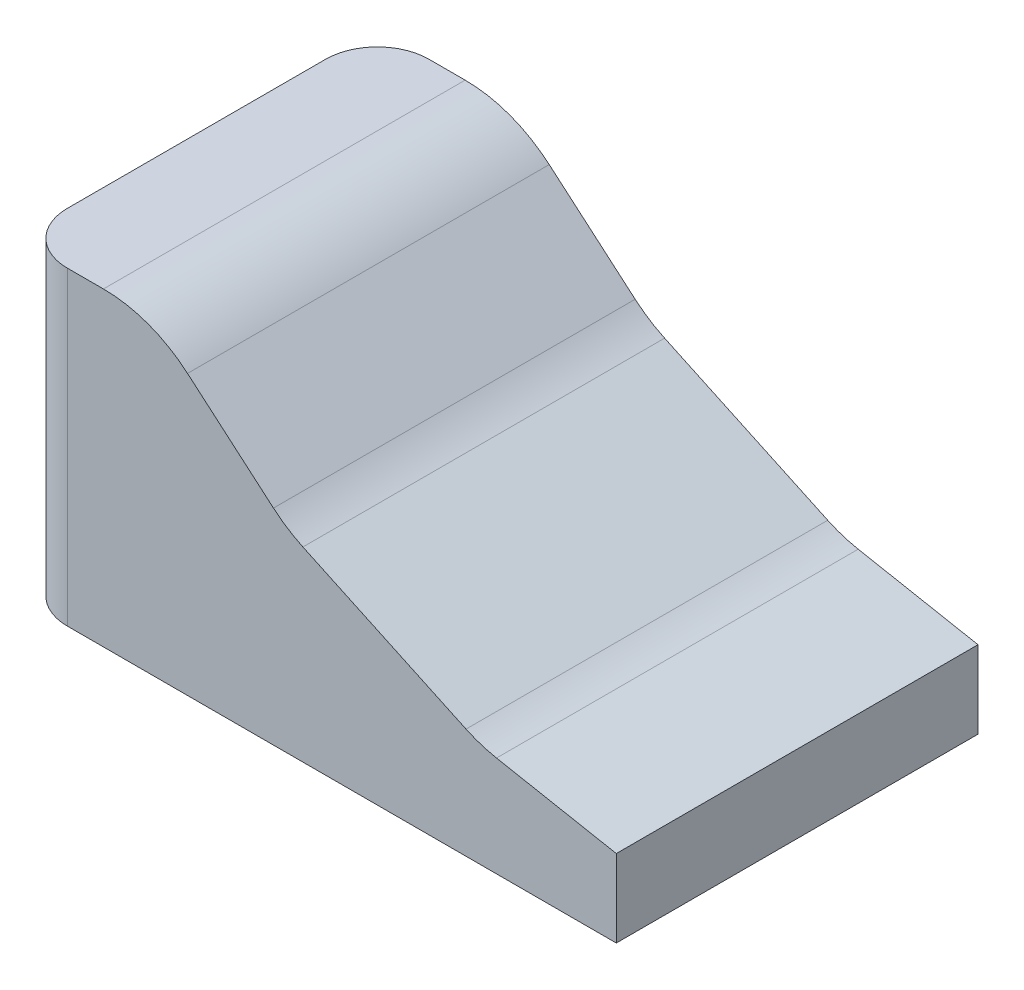
ISO-10303-21;
HEADER;
FILE_DESCRIPTION(('STEP AP214'),'2;1');
FILE_NAME('part.step','',(''),(''),'','','');
FILE_SCHEMA(('AUTOMOTIVE_DESIGN { 1 0 10303 214 1 1 1 1 }'));
ENDSEC;
DATA;
#1=APPLICATION_CONTEXT('core data for automotive mechanical design processes');
#2=APPLICATION_PROTOCOL_DEFINITION('international standard','automotive_design',2000,#1);
#3=PRODUCT_CONTEXT('',#1,'mechanical');
#4=PRODUCT('Part','Part','',(#3));
#5=PRODUCT_RELATED_PRODUCT_CATEGORY('part','',(#4));
#6=PRODUCT_DEFINITION_FORMATION('','',#4);
#7=PRODUCT_DEFINITION_CONTEXT('part definition',#1,'design');
#8=PRODUCT_DEFINITION('design','',#6,#7);
#9=PRODUCT_DEFINITION_SHAPE('','',#8);
#10=(LENGTH_UNIT() NAMED_UNIT(*) SI_UNIT(.MILLI.,.METRE.));
#11=(NAMED_UNIT(*) PLANE_ANGLE_UNIT() SI_UNIT($,.RADIAN.));
#12=(NAMED_UNIT(*) SI_UNIT($,.STERADIAN.) SOLID_ANGLE_UNIT());
#13=UNCERTAINTY_MEASURE_WITH_UNIT(LENGTH_MEASURE(1.E-05),#10,'distance_accuracy_value','');
#14=(GEOMETRIC_REPRESENTATION_CONTEXT(3) GLOBAL_UNCERTAINTY_ASSIGNED_CONTEXT((#13)) GLOBAL_UNIT_ASSIGNED_CONTEXT((#10,
#11,#12)) REPRESENTATION_CONTEXT('',''));
#15=CARTESIAN_POINT('',(0.,0.,0.));
#16=DIRECTION('',(0.,0.,1.));
#17=DIRECTION('',(1.,0.,0.));
#18=AXIS2_PLACEMENT_3D('',#15,#16,#17);
#19=CARTESIAN_POINT('',(228.600000000029,50.8,-177.8));
#20=DIRECTION('',(0.422885465331046,0.906183139995302,0.));
#21=DIRECTION('',(-0.906183139995302,0.422885465331046,0.));
#22=AXIS2_PLACEMENT_3D('',#19,#20,#21);
#23=PLANE('',#22);
#24=DIRECTION('',(-0.906183139995302,0.422885465331046,0.));
#25=VECTOR('',#24,1.);
#26=CARTESIAN_POINT('',(228.600000000029,50.8,0.));
#27=LINE('',#26,#25);
#28=CARTESIAN_POINT('',(221.416064077509,54.1525034305082,0.));
#29=VERTEX_POINT('',#28);
#30=CARTESIAN_POINT('',(141.224379885032,91.5752893869893,0.));
#31=VERTEX_POINT('',#30);
#32=EDGE_CURVE('E152',#29,#31,#27,.T.);
#33=ORIENTED_EDGE('',*,*,#32,.F.);
#34=DIRECTION('',(0.,0.,1.));
#35=VECTOR('',#34,1.);
#36=CARTESIAN_POINT('',(221.416064077509,54.1525034305082,-177.8));
#37=LINE('',#36,#35);
#38=CARTESIAN_POINT('',(221.416064077509,54.1525034305082,-177.8));
#39=VERTEX_POINT('',#38);
#40=EDGE_CURVE('E177',#29,#39,#37,.F.);
#41=ORIENTED_EDGE('',*,*,#40,.T.);
#42=DIRECTION('',(-0.906183139995302,0.422885465331046,0.));
#43=VECTOR('',#42,1.);
#44=CARTESIAN_POINT('',(228.600000000029,50.8,-177.8));
#45=LINE('',#44,#43);
#46=CARTESIAN_POINT('',(141.224379885032,91.5752893869893,-177.8));
#47=VERTEX_POINT('',#46);
#48=EDGE_CURVE('E166',#39,#47,#45,.T.);
#49=ORIENTED_EDGE('',*,*,#48,.T.);
#50=DIRECTION('',(0.,0.,1.));
#51=VECTOR('',#50,1.);
#52=CARTESIAN_POINT('',(141.224379885032,91.5752893869893,0.));
#53=LINE('',#52,#51);
#54=EDGE_CURVE('E174',#47,#31,#53,.T.);
#55=ORIENTED_EDGE('',*,*,#54,.T.);
#56=EDGE_LOOP('',(#33,#41,#49,#55));
#57=FACE_BOUND('',#56,.T.);
#58=ADVANCED_FACE('F31',(#57),#23,.T.);
#59=CARTESIAN_POINT('',(295.275,38.1,-177.8));
#60=DIRECTION('',(0.187112107890072,0.98233856642246,0.));
#61=DIRECTION('',(-0.98233856642246,0.187112107890072,0.));
#62=AXIS2_PLACEMENT_3D('',#59,#60,#61);
#63=PLANE('',#62);
#64=DIRECTION('',(-0.98233856642246,0.187112107890072,0.));
#65=VECTOR('',#64,1.);
#66=CARTESIAN_POINT('',(295.275,38.1,-177.8));
#67=LINE('',#66,#65);
#68=CARTESIAN_POINT('',(295.275,38.1,-177.8));
#69=VERTEX_POINT('',#68);
#70=CARTESIAN_POINT('',(236.387672275011,49.3166338523836,-177.8));
#71=VERTEX_POINT('',#70);
#72=EDGE_CURVE('E146',#69,#71,#67,.T.);
#73=ORIENTED_EDGE('',*,*,#72,.T.);
#74=DIRECTION('',(0.,0.,1.));
#75=VECTOR('',#74,1.);
#76=CARTESIAN_POINT('',(236.387672275011,49.3166338523836,0.));
#77=LINE('',#76,#75);
#78=CARTESIAN_POINT('',(236.387672275011,49.3166338523836,0.));
#79=VERTEX_POINT('',#78);
#80=EDGE_CURVE('E167',#71,#79,#77,.T.);
#81=ORIENTED_EDGE('',*,*,#80,.T.);
#82=DIRECTION('',(-0.98233856642246,0.187112107890072,0.));
#83=VECTOR('',#82,1.);
#84=CARTESIAN_POINT('',(295.275,38.1,0.));
#85=LINE('',#84,#83);
#86=CARTESIAN_POINT('',(295.275,38.1,0.));
#87=VERTEX_POINT('',#86);
#88=EDGE_CURVE('E163',#87,#79,#85,.T.);
#89=ORIENTED_EDGE('',*,*,#88,.F.);
#90=DIRECTION('',(0.,0.,1.));
#91=VECTOR('',#90,1.);
#92=CARTESIAN_POINT('',(295.275,38.1,-177.8));
#93=LINE('',#92,#91);
#94=EDGE_CURVE('E141',#69,#87,#93,.T.);
#95=ORIENTED_EDGE('',*,*,#94,.F.);
#96=EDGE_LOOP('',(#73,#81,#89,#95));
#97=FACE_BOUND('',#96,.T.);
#98=ADVANCED_FACE('F227',(#97),#63,.T.);
#99=CARTESIAN_POINT('',(295.275,0.,-177.8));
#100=DIRECTION('',(1.,0.,0.));
#101=DIRECTION('',(0.,0.,-1.));
#102=AXIS2_PLACEMENT_3D('',#99,#100,#101);
#103=PLANE('',#102);
#104=DIRECTION('',(0.,1.,0.));
#105=VECTOR('',#104,1.);
#106=CARTESIAN_POINT('',(295.275,0.,0.));
#107=LINE('',#106,#105);
#108=CARTESIAN_POINT('',(295.275,0.,0.));
#109=VERTEX_POINT('',#108);
#110=EDGE_CURVE('E140',#109,#87,#107,.T.);
#111=ORIENTED_EDGE('',*,*,#110,.F.);
#112=DIRECTION('',(0.,0.,1.));
#113=VECTOR('',#112,1.);
#114=CARTESIAN_POINT('',(295.275,0.,-177.8));
#115=LINE('',#114,#113);
#116=CARTESIAN_POINT('',(295.275,0.,-177.8));
#117=VERTEX_POINT('',#116);
#118=EDGE_CURVE('E128',#117,#109,#115,.T.);
#119=ORIENTED_EDGE('',*,*,#118,.F.);
#120=DIRECTION('',(0.,1.,0.));
#121=VECTOR('',#120,1.);
#122=CARTESIAN_POINT('',(295.275,0.,-177.8));
#123=LINE('',#122,#121);
#124=EDGE_CURVE('E132',#117,#69,#123,.T.);
#125=ORIENTED_EDGE('',*,*,#124,.T.);
#126=ORIENTED_EDGE('',*,*,#94,.T.);
#127=EDGE_LOOP('',(#111,#119,#125,#126));
#128=FACE_BOUND('',#127,.T.);
#129=ADVANCED_FACE('F137',(#128),#103,.T.);
#130=CARTESIAN_POINT('',(0.,0.,-177.8));
#131=DIRECTION('',(0.,-1.,0.));
#132=DIRECTION('',(0.,0.,-1.));
#133=AXIS2_PLACEMENT_3D('',#130,#131,#132);
#134=PLANE('',#133);
#135=DIRECTION('',(0.,0.,1.));
#136=VECTOR('',#135,1.);
#137=CARTESIAN_POINT('',(0.,0.,-177.8));
#138=LINE('',#137,#136);
#139=CARTESIAN_POINT('',(0.,0.,-152.4));
#140=VERTEX_POINT('',#139);
#141=CARTESIAN_POINT('',(0.,0.,-25.4));
#142=VERTEX_POINT('',#141);
#143=EDGE_CURVE('E142',#140,#142,#138,.T.);
#144=ORIENTED_EDGE('',*,*,#143,.F.);
#145=CARTESIAN_POINT('',(25.4,0.,-152.4));
#146=DIRECTION('',(0.,-1.,0.));
#147=DIRECTION('',(0.,0.,-1.));
#148=AXIS2_PLACEMENT_3D('',#145,#146,#147);
#149=CIRCLE('',#148,25.4);
#150=CARTESIAN_POINT('',(25.4,0.,-177.8));
#151=VERTEX_POINT('',#150);
#152=EDGE_CURVE('E130',#140,#151,#149,.T.);
#153=ORIENTED_EDGE('',*,*,#152,.T.);
#154=DIRECTION('',(1.,0.,0.));
#155=VECTOR('',#154,1.);
#156=CARTESIAN_POINT('',(0.,0.,-177.8));
#157=LINE('',#156,#155);
#158=EDGE_CURVE('E123',#151,#117,#157,.T.);
#159=ORIENTED_EDGE('',*,*,#158,.T.);
#160=ORIENTED_EDGE('',*,*,#118,.T.);
#161=DIRECTION('',(1.,0.,0.));
#162=VECTOR('',#161,1.);
#163=CARTESIAN_POINT('',(0.,0.,0.));
#164=LINE('',#163,#162);
#165=CARTESIAN_POINT('',(25.4,0.,0.));
#166=VERTEX_POINT('',#165);
#167=EDGE_CURVE('E160',#166,#109,#164,.T.);
#168=ORIENTED_EDGE('',*,*,#167,.F.);
#169=CARTESIAN_POINT('',(25.4,0.,-25.4));
#170=DIRECTION('',(0.,-1.,0.));
#171=DIRECTION('',(0.,0.,-1.));
#172=AXIS2_PLACEMENT_3D('',#169,#170,#171);
#173=CIRCLE('',#172,25.4);
#174=EDGE_CURVE('E203',#166,#142,#173,.T.);
#175=ORIENTED_EDGE('',*,*,#174,.T.);
#176=EDGE_LOOP('',(#144,#153,#159,#160,#168,#175));
#177=FACE_BOUND('',#176,.T.);
#178=ADVANCED_FACE('F126',(#177),#134,.T.);
#179=CARTESIAN_POINT('',(0.,152.4,-177.8));
#180=DIRECTION('',(-1.,0.,0.));
#181=DIRECTION('',(0.,-1.,0.));
#182=AXIS2_PLACEMENT_3D('',#179,#180,#181);
#183=PLANE('',#182);
#184=DIRECTION('',(0.,0.,1.));
#185=VECTOR('',#184,1.);
#186=CARTESIAN_POINT('',(0.,152.4,-177.8));
#187=LINE('',#186,#185);
#188=CARTESIAN_POINT('',(0.,152.4,-152.4));
#189=VERTEX_POINT('',#188);
#190=CARTESIAN_POINT('',(0.,152.4,-25.4));
#191=VERTEX_POINT('',#190);
#192=EDGE_CURVE('E148',#189,#191,#187,.T.);
#193=ORIENTED_EDGE('',*,*,#192,.F.);
#194=DIRECTION('',(0.,-1.,0.));
#195=VECTOR('',#194,1.);
#196=CARTESIAN_POINT('',(0.,0.,-152.4));
#197=LINE('',#196,#195);
#198=EDGE_CURVE('E200',#189,#140,#197,.T.);
#199=ORIENTED_EDGE('',*,*,#198,.T.);
#200=ORIENTED_EDGE('',*,*,#143,.T.);
#201=DIRECTION('',(0.,-1.,0.));
#202=VECTOR('',#201,1.);
#203=CARTESIAN_POINT('',(0.,152.4,-25.4));
#204=LINE('',#203,#202);
#205=EDGE_CURVE('E198',#142,#191,#204,.F.);
#206=ORIENTED_EDGE('',*,*,#205,.T.);
#207=EDGE_LOOP('',(#193,#199,#200,#206));
#208=FACE_BOUND('',#207,.T.);
#209=ADVANCED_FACE('F213',(#208),#183,.T.);
#210=CARTESIAN_POINT('',(66.675000000032,152.4,-177.8));
#211=DIRECTION('',(0.,1.,0.));
#212=DIRECTION('',(0.,0.,1.));
#213=AXIS2_PLACEMENT_3D('',#210,#211,#212);
#214=PLANE('',#213);
#215=DIRECTION('',(-1.,0.,0.));
#216=VECTOR('',#215,1.);
#217=CARTESIAN_POINT('',(66.675000000032,152.4,-177.8));
#218=LINE('',#217,#216);
#219=CARTESIAN_POINT('',(43.1848211603423,152.4,-177.8));
#220=VERTEX_POINT('',#219);
#221=CARTESIAN_POINT('',(25.4,152.4,-177.8));
#222=VERTEX_POINT('',#221);
#223=EDGE_CURVE('E133',#220,#222,#218,.T.);
#224=ORIENTED_EDGE('',*,*,#223,.T.);
#225=CARTESIAN_POINT('',(25.4,152.4,-152.4));
#226=DIRECTION('',(0.,1.,0.));
#227=DIRECTION('',(0.,0.,1.));
#228=AXIS2_PLACEMENT_3D('',#225,#226,#227);
#229=CIRCLE('',#228,25.4);
#230=EDGE_CURVE('E39',#222,#189,#229,.T.);
#231=ORIENTED_EDGE('',*,*,#230,.T.);
#232=ORIENTED_EDGE('',*,*,#192,.T.);
#233=CARTESIAN_POINT('',(25.4,152.4,-25.4));
#234=DIRECTION('',(0.,1.,0.));
#235=DIRECTION('',(0.,0.,1.));
#236=AXIS2_PLACEMENT_3D('',#233,#234,#235);
#237=CIRCLE('',#236,25.4);
#238=CARTESIAN_POINT('',(25.4,152.4,0.));
#239=VERTEX_POINT('',#238);
#240=EDGE_CURVE('E46',#191,#239,#237,.T.);
#241=ORIENTED_EDGE('',*,*,#240,.T.);
#242=DIRECTION('',(-1.,0.,0.));
#243=VECTOR('',#242,1.);
#244=CARTESIAN_POINT('',(66.675000000032,152.4,0.));
#245=LINE('',#244,#243);
#246=CARTESIAN_POINT('',(43.1848211603423,152.4,0.));
#247=VERTEX_POINT('',#246);
#248=EDGE_CURVE('E158',#247,#239,#245,.T.);
#249=ORIENTED_EDGE('',*,*,#248,.F.);
#250=DIRECTION('',(0.,0.,1.));
#251=VECTOR('',#250,1.);
#252=CARTESIAN_POINT('',(43.1848211603423,152.4,-177.8));
#253=LINE('',#252,#251);
#254=EDGE_CURVE('E186',#247,#220,#253,.F.);
#255=ORIENTED_EDGE('',*,*,#254,.T.);
#256=EDGE_LOOP('',(#224,#231,#232,#241,#249,#255));
#257=FACE_BOUND('',#256,.T.);
#258=ADVANCED_FACE('F209',(#257),#214,.T.);
#259=CARTESIAN_POINT('',(133.350000000007,95.25,-177.8));
#260=DIRECTION('',(0.650791373456108,0.759256602365177,0.));
#261=DIRECTION('',(-0.759256602365177,0.650791373456108,0.));
#262=AXIS2_PLACEMENT_3D('',#259,#260,#261);
#263=PLANE('',#262);
#264=DIRECTION('',(-0.759256602365177,0.650791373456108,0.));
#265=VECTOR('',#264,1.);
#266=CARTESIAN_POINT('',(133.350000000007,95.25,0.));
#267=LINE('',#266,#265);
#268=CARTESIAN_POINT('',(126.75235471909,100.905124526502,0.));
#269=VERTEX_POINT('',#268);
#270=CARTESIAN_POINT('',(84.5100733748052,137.112794250189,0.));
#271=VERTEX_POINT('',#270);
#272=EDGE_CURVE('E155',#269,#271,#267,.T.);
#273=ORIENTED_EDGE('',*,*,#272,.F.);
#274=DIRECTION('',(0.,0.,1.));
#275=VECTOR('',#274,1.);
#276=CARTESIAN_POINT('',(126.75235471909,100.905124526502,-177.8));
#277=LINE('',#276,#275);
#278=CARTESIAN_POINT('',(126.75235471909,100.905124526502,-177.8));
#279=VERTEX_POINT('',#278);
#280=EDGE_CURVE('E182',#269,#279,#277,.F.);
#281=ORIENTED_EDGE('',*,*,#280,.T.);
#282=DIRECTION('',(-0.759256602365177,0.650791373456108,0.));
#283=VECTOR('',#282,1.);
#284=CARTESIAN_POINT('',(133.350000000007,95.25,-177.8));
#285=LINE('',#284,#283);
#286=CARTESIAN_POINT('',(84.5100733748052,137.112794250189,-177.8));
#287=VERTEX_POINT('',#286);
#288=EDGE_CURVE('E257',#279,#287,#285,.T.);
#289=ORIENTED_EDGE('',*,*,#288,.T.);
#290=DIRECTION('',(0.,0.,1.));
#291=VECTOR('',#290,1.);
#292=CARTESIAN_POINT('',(84.5100733748052,137.112794250189,-177.8));
#293=LINE('',#292,#291);
#294=EDGE_CURVE('E179',#287,#271,#293,.T.);
#295=ORIENTED_EDGE('',*,*,#294,.T.);
#296=EDGE_LOOP('',(#273,#281,#289,#295));
#297=FACE_BOUND('',#296,.T.);
#298=ADVANCED_FACE('F238',(#297),#263,.T.);
#299=CARTESIAN_POINT('',(0.,157.479999999989,-177.8));
#300=DIRECTION('',(0.,0.,1.));
#301=DIRECTION('',(1.,0.,0.));
#302=AXIS2_PLACEMENT_3D('',#299,#300,#301);
#303=PLANE('',#302);
#304=ORIENTED_EDGE('',*,*,#158,.F.);
#305=DIRECTION('',(0.,-1.,0.));
#306=VECTOR('',#305,1.);
#307=CARTESIAN_POINT('',(25.4,152.4,-177.8));
#308=LINE('',#307,#306);
#309=EDGE_CURVE('E54',#151,#222,#308,.F.);
#310=ORIENTED_EDGE('',*,*,#309,.T.);
#311=ORIENTED_EDGE('',*,*,#223,.F.);
#312=CARTESIAN_POINT('',(43.1848211603423,88.9,-177.8));
#313=DIRECTION('',(0.,0.,1.));
#314=DIRECTION('',(1.,0.,0.));
#315=AXIS2_PLACEMENT_3D('',#312,#313,#314);
#316=CIRCLE('',#315,63.5);
#317=EDGE_CURVE('E188',#220,#287,#316,.F.);
#318=ORIENTED_EDGE('',*,*,#317,.T.);
#319=ORIENTED_EDGE('',*,*,#288,.F.);
#320=CARTESIAN_POINT('',(168.077606933553,149.117918776691,-177.8));
#321=DIRECTION('',(0.,0.,1.));
#322=DIRECTION('',(1.,0.,0.));
#323=AXIS2_PLACEMENT_3D('',#320,#321,#322);
#324=CIRCLE('',#323,63.5);
#325=EDGE_CURVE('E196',#279,#47,#324,.T.);
#326=ORIENTED_EDGE('',*,*,#325,.T.);
#327=ORIENTED_EDGE('',*,*,#48,.F.);
#328=CARTESIAN_POINT('',(248.269291126031,111.69513282021,-177.8));
#329=DIRECTION('',(0.,0.,1.));
#330=DIRECTION('',(1.,0.,0.));
#331=AXIS2_PLACEMENT_3D('',#328,#329,#330);
#332=CIRCLE('',#331,63.5);
#333=EDGE_CURVE('E192',#39,#71,#332,.T.);
#334=ORIENTED_EDGE('',*,*,#333,.T.);
#335=ORIENTED_EDGE('',*,*,#72,.F.);
#336=ORIENTED_EDGE('',*,*,#124,.F.);
#337=EDGE_LOOP('',(#304,#310,#311,#318,#319,#326,#327,#334,#335,#336));
#338=FACE_BOUND('',#337,.T.);
#339=ADVANCED_FACE('F144',(#338),#303,.F.);
#340=CARTESIAN_POINT('',(0.,157.479999999989,0.));
#341=DIRECTION('',(0.,0.,1.));
#342=DIRECTION('',(1.,0.,0.));
#343=AXIS2_PLACEMENT_3D('',#340,#341,#342);
#344=PLANE('',#343);
#345=ORIENTED_EDGE('',*,*,#248,.T.);
#346=DIRECTION('',(0.,-1.,0.));
#347=VECTOR('',#346,1.);
#348=CARTESIAN_POINT('',(25.4,157.479999999989,0.));
#349=LINE('',#348,#347);
#350=EDGE_CURVE('E11',#239,#166,#349,.T.);
#351=ORIENTED_EDGE('',*,*,#350,.T.);
#352=ORIENTED_EDGE('',*,*,#167,.T.);
#353=ORIENTED_EDGE('',*,*,#110,.T.);
#354=ORIENTED_EDGE('',*,*,#88,.T.);
#355=CARTESIAN_POINT('',(248.269291126031,111.69513282021,0.));
#356=DIRECTION('',(0.,0.,1.));
#357=DIRECTION('',(1.,0.,0.));
#358=AXIS2_PLACEMENT_3D('',#355,#356,#357);
#359=CIRCLE('',#358,63.5);
#360=EDGE_CURVE('E190',#79,#29,#359,.F.);
#361=ORIENTED_EDGE('',*,*,#360,.T.);
#362=ORIENTED_EDGE('',*,*,#32,.T.);
#363=CARTESIAN_POINT('',(168.077606933553,149.117918776691,0.));
#364=DIRECTION('',(0.,0.,1.));
#365=DIRECTION('',(1.,0.,0.));
#366=AXIS2_PLACEMENT_3D('',#363,#364,#365);
#367=CIRCLE('',#366,63.5);
#368=EDGE_CURVE('E194',#31,#269,#367,.F.);
#369=ORIENTED_EDGE('',*,*,#368,.T.);
#370=ORIENTED_EDGE('',*,*,#272,.T.);
#371=CARTESIAN_POINT('',(43.1848211603423,88.9,0.));
#372=DIRECTION('',(0.,0.,1.));
#373=DIRECTION('',(1.,0.,0.));
#374=AXIS2_PLACEMENT_3D('',#371,#372,#373);
#375=CIRCLE('',#374,63.5);
#376=EDGE_CURVE('E184',#271,#247,#375,.T.);
#377=ORIENTED_EDGE('',*,*,#376,.T.);
#378=EDGE_LOOP('',(#345,#351,#352,#353,#354,#361,#362,#369,#370,#377));
#379=FACE_BOUND('',#378,.T.);
#380=ADVANCED_FACE('F243',(#379),#344,.T.);
#381=CARTESIAN_POINT('',(248.269291126031,111.69513282021,-177.8));
#382=DIRECTION('',(0.,0.,-1.));
#383=DIRECTION('',(-1.,0.,0.));
#384=AXIS2_PLACEMENT_3D('',#381,#382,#383);
#385=CYLINDRICAL_SURFACE('',#384,63.5);
#386=ORIENTED_EDGE('',*,*,#333,.F.);
#387=ORIENTED_EDGE('',*,*,#40,.F.);
#388=ORIENTED_EDGE('',*,*,#360,.F.);
#389=ORIENTED_EDGE('',*,*,#80,.F.);
#390=EDGE_LOOP('',(#386,#387,#388,#389));
#391=FACE_BOUND('',#390,.T.);
#392=ADVANCED_FACE('F240',(#391),#385,.F.);
#393=CARTESIAN_POINT('',(168.077606933553,149.117918776691,-177.8));
#394=DIRECTION('',(0.,0.,-1.));
#395=DIRECTION('',(-1.,0.,0.));
#396=AXIS2_PLACEMENT_3D('',#393,#394,#395);
#397=CYLINDRICAL_SURFACE('',#396,63.5);
#398=ORIENTED_EDGE('',*,*,#325,.F.);
#399=ORIENTED_EDGE('',*,*,#280,.F.);
#400=ORIENTED_EDGE('',*,*,#368,.F.);
#401=ORIENTED_EDGE('',*,*,#54,.F.);
#402=EDGE_LOOP('',(#398,#399,#400,#401));
#403=FACE_BOUND('',#402,.T.);
#404=ADVANCED_FACE('F223',(#403),#397,.F.);
#405=CARTESIAN_POINT('',(43.1848211603423,88.9,-177.8));
#406=DIRECTION('',(0.,0.,1.));
#407=DIRECTION('',(1.,0.,0.));
#408=AXIS2_PLACEMENT_3D('',#405,#406,#407);
#409=CYLINDRICAL_SURFACE('',#408,63.5);
#410=ORIENTED_EDGE('',*,*,#317,.F.);
#411=ORIENTED_EDGE('',*,*,#254,.F.);
#412=ORIENTED_EDGE('',*,*,#376,.F.);
#413=ORIENTED_EDGE('',*,*,#294,.F.);
#414=EDGE_LOOP('',(#410,#411,#412,#413));
#415=FACE_BOUND('',#414,.T.);
#416=ADVANCED_FACE('F217',(#415),#409,.T.);
#417=CARTESIAN_POINT('',(25.4,152.4,-152.4));
#418=DIRECTION('',(0.,1.,0.));
#419=DIRECTION('',(-1.,0.,0.));
#420=AXIS2_PLACEMENT_3D('',#417,#418,#419);
#421=CYLINDRICAL_SURFACE('',#420,25.4);
#422=ORIENTED_EDGE('',*,*,#230,.F.);
#423=ORIENTED_EDGE('',*,*,#309,.F.);
#424=ORIENTED_EDGE('',*,*,#152,.F.);
#425=ORIENTED_EDGE('',*,*,#198,.F.);
#426=EDGE_LOOP('',(#422,#423,#424,#425));
#427=FACE_BOUND('',#426,.T.);
#428=ADVANCED_FACE('F215',(#427),#421,.T.);
#429=CARTESIAN_POINT('',(25.4,157.479999999989,-25.4));
#430=DIRECTION('',(0.,-1.,0.));
#431=DIRECTION('',(1.,0.,0.));
#432=AXIS2_PLACEMENT_3D('',#429,#430,#431);
#433=CYLINDRICAL_SURFACE('',#432,25.4);
#434=ORIENTED_EDGE('',*,*,#240,.F.);
#435=ORIENTED_EDGE('',*,*,#205,.F.);
#436=ORIENTED_EDGE('',*,*,#174,.F.);
#437=ORIENTED_EDGE('',*,*,#350,.F.);
#438=EDGE_LOOP('',(#434,#435,#436,#437));
#439=FACE_BOUND('',#438,.T.);
#440=ADVANCED_FACE('F33',(#439),#433,.T.);
#441=CLOSED_SHELL('',(#58,#98,#129,#178,#209,#258,#298,#339,#380,#392,#404,#416,#428,#440));
#442=MANIFOLD_SOLID_BREP('B2',#441);
#443=ADVANCED_BREP_SHAPE_REPRESENTATION('',(#18,#442),#14);
#444=SHAPE_DEFINITION_REPRESENTATION(#9,#443);
ENDSEC;
END-ISO-10303-21;
